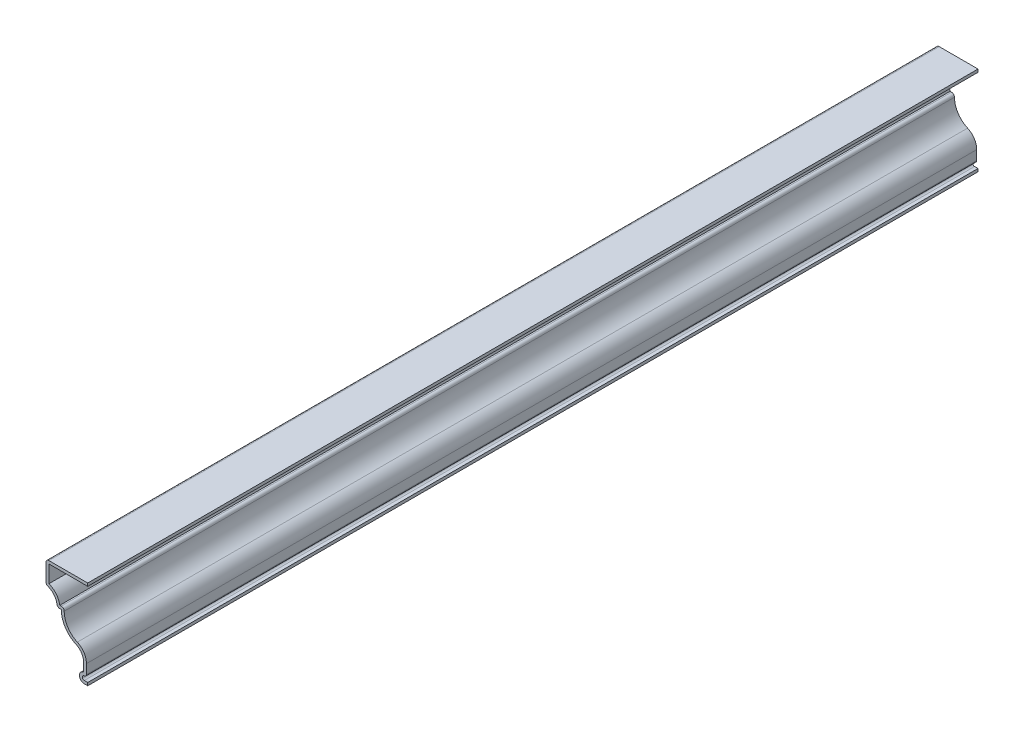
ISO-10303-21;
HEADER;
FILE_DESCRIPTION(('STEP AP214'),'2;1');
FILE_NAME('part.step','',(''),(''),'','','');
FILE_SCHEMA(('AUTOMOTIVE_DESIGN { 1 0 10303 214 1 1 1 1 }'));
ENDSEC;
DATA;
#1=APPLICATION_CONTEXT('core data for automotive mechanical design processes');
#2=APPLICATION_PROTOCOL_DEFINITION('international standard','automotive_design',2000,#1);
#3=PRODUCT_CONTEXT('',#1,'mechanical');
#4=PRODUCT('Part','Part','',(#3));
#5=PRODUCT_RELATED_PRODUCT_CATEGORY('part','',(#4));
#6=PRODUCT_DEFINITION_FORMATION('','',#4);
#7=PRODUCT_DEFINITION_CONTEXT('part definition',#1,'design');
#8=PRODUCT_DEFINITION('design','',#6,#7);
#9=PRODUCT_DEFINITION_SHAPE('','',#8);
#10=(LENGTH_UNIT() NAMED_UNIT(*) SI_UNIT(.MILLI.,.METRE.));
#11=(NAMED_UNIT(*) PLANE_ANGLE_UNIT() SI_UNIT($,.RADIAN.));
#12=(NAMED_UNIT(*) SI_UNIT($,.STERADIAN.) SOLID_ANGLE_UNIT());
#13=UNCERTAINTY_MEASURE_WITH_UNIT(LENGTH_MEASURE(1.E-05),#10,'distance_accuracy_value','');
#14=(GEOMETRIC_REPRESENTATION_CONTEXT(3) GLOBAL_UNCERTAINTY_ASSIGNED_CONTEXT((#13)) GLOBAL_UNIT_ASSIGNED_CONTEXT((#10,
#11,#12)) REPRESENTATION_CONTEXT('',''));
#15=CARTESIAN_POINT('',(0.,0.,0.));
#16=DIRECTION('',(0.,0.,1.));
#17=DIRECTION('',(1.,0.,0.));
#18=AXIS2_PLACEMENT_3D('',#15,#16,#17);
#19=CARTESIAN_POINT('',(0.,1.651,-508.));
#20=DIRECTION('',(1.,0.,0.));
#21=DIRECTION('',(0.,0.,-1.));
#22=AXIS2_PLACEMENT_3D('',#19,#20,#21);
#23=PLANE('',#22);
#24=DIRECTION('',(0.,1.,0.));
#25=VECTOR('',#24,1.);
#26=CARTESIAN_POINT('',(0.,1.651,0.));
#27=LINE('',#26,#25);
#28=CARTESIAN_POINT('',(0.,0.,0.));
#29=VERTEX_POINT('',#28);
#30=CARTESIAN_POINT('',(0.,1.651,0.));
#31=VERTEX_POINT('',#30);
#32=EDGE_CURVE('E287',#29,#31,#27,.T.);
#33=ORIENTED_EDGE('',*,*,#32,.F.);
#34=DIRECTION('',(0.,0.,1.));
#35=VECTOR('',#34,1.);
#36=CARTESIAN_POINT('',(0.,0.,-508.));
#37=LINE('',#36,#35);
#38=CARTESIAN_POINT('',(0.,0.,-508.));
#39=VERTEX_POINT('',#38);
#40=EDGE_CURVE('E230',#39,#29,#37,.T.);
#41=ORIENTED_EDGE('',*,*,#40,.F.);
#42=DIRECTION('',(0.,1.,0.));
#43=VECTOR('',#42,1.);
#44=CARTESIAN_POINT('',(0.,1.651,-508.));
#45=LINE('',#44,#43);
#46=CARTESIAN_POINT('',(0.,1.651,-508.));
#47=VERTEX_POINT('',#46);
#48=EDGE_CURVE('E224',#39,#47,#45,.T.);
#49=ORIENTED_EDGE('',*,*,#48,.T.);
#50=DIRECTION('',(0.,0.,1.));
#51=VECTOR('',#50,1.);
#52=CARTESIAN_POINT('',(0.,1.651,-508.));
#53=LINE('',#52,#51);
#54=EDGE_CURVE('E206',#47,#31,#53,.T.);
#55=ORIENTED_EDGE('',*,*,#54,.T.);
#56=EDGE_LOOP('',(#33,#41,#49,#55));
#57=FACE_BOUND('',#56,.T.);
#58=ADVANCED_FACE('F39',(#57),#23,.T.);
#59=CARTESIAN_POINT('',(0.,0.,-508.));
#60=DIRECTION('',(0.,-1.,0.));
#61=DIRECTION('',(1.,0.,0.));
#62=AXIS2_PLACEMENT_3D('',#59,#60,#61);
#63=PLANE('',#62);
#64=DIRECTION('',(1.,0.,0.));
#65=VECTOR('',#64,1.);
#66=CARTESIAN_POINT('',(0.,0.,0.));
#67=LINE('',#66,#65);
#68=CARTESIAN_POINT('',(-1.96908792936124,0.,0.));
#69=VERTEX_POINT('',#68);
#70=EDGE_CURVE('E231',#69,#29,#67,.T.);
#71=ORIENTED_EDGE('',*,*,#70,.F.);
#72=DIRECTION('',(0.,0.,1.));
#73=VECTOR('',#72,1.);
#74=CARTESIAN_POINT('',(-1.96908792936124,0.,-508.));
#75=LINE('',#74,#73);
#76=CARTESIAN_POINT('',(-1.96908792936124,0.,-508.));
#77=VERTEX_POINT('',#76);
#78=EDGE_CURVE('E343',#77,#69,#75,.T.);
#79=ORIENTED_EDGE('',*,*,#78,.F.);
#80=DIRECTION('',(1.,0.,0.));
#81=VECTOR('',#80,1.);
#82=CARTESIAN_POINT('',(0.,0.,-508.));
#83=LINE('',#82,#81);
#84=EDGE_CURVE('E217',#77,#39,#83,.T.);
#85=ORIENTED_EDGE('',*,*,#84,.T.);
#86=ORIENTED_EDGE('',*,*,#40,.T.);
#87=EDGE_LOOP('',(#71,#79,#85,#86));
#88=FACE_BOUND('',#87,.T.);
#89=ADVANCED_FACE('F427',(#88),#63,.T.);
#90=CARTESIAN_POINT('',(-1.96908792936124,2.79341207063876,-508.));
#91=DIRECTION('',(0.,0.,1.));
#92=DIRECTION('',(1.,0.,0.));
#93=AXIS2_PLACEMENT_3D('',#90,#91,#92);
#94=CYLINDRICAL_SURFACE('',#93,2.79341207063876);
#95=CARTESIAN_POINT('',(-1.96908792936124,2.79341207063876,0.));
#96=DIRECTION('',(0.,0.,1.));
#97=DIRECTION('',(-1.,0.,0.));
#98=AXIS2_PLACEMENT_3D('',#95,#96,#97);
#99=CIRCLE('',#98,2.79341207063876);
#100=CARTESIAN_POINT('',(-2.38125,5.55625,0.));
#101=VERTEX_POINT('',#100);
#102=EDGE_CURVE('E234',#101,#69,#99,.T.);
#103=ORIENTED_EDGE('',*,*,#102,.F.);
#104=DIRECTION('',(0.,0.,1.));
#105=VECTOR('',#104,1.);
#106=CARTESIAN_POINT('',(-2.38125,5.55625,-508.));
#107=LINE('',#106,#105);
#108=CARTESIAN_POINT('',(-2.38125,5.55625,-508.));
#109=VERTEX_POINT('',#108);
#110=EDGE_CURVE('E345',#109,#101,#107,.T.);
#111=ORIENTED_EDGE('',*,*,#110,.F.);
#112=CARTESIAN_POINT('',(-1.96908792936124,2.79341207063876,-508.));
#113=DIRECTION('',(0.,0.,1.));
#114=DIRECTION('',(-1.,0.,0.));
#115=AXIS2_PLACEMENT_3D('',#112,#113,#114);
#116=CIRCLE('',#115,2.79341207063876);
#117=EDGE_CURVE('E283',#109,#77,#116,.T.);
#118=ORIENTED_EDGE('',*,*,#117,.T.);
#119=ORIENTED_EDGE('',*,*,#78,.T.);
#120=EDGE_LOOP('',(#103,#111,#118,#119));
#121=FACE_BOUND('',#120,.T.);
#122=ADVANCED_FACE('F500',(#121),#94,.T.);
#123=CARTESIAN_POINT('',(-2.38125,5.55625,-508.));
#124=DIRECTION('',(-1.,0.,0.));
#125=DIRECTION('',(0.,-1.,0.));
#126=AXIS2_PLACEMENT_3D('',#123,#124,#125);
#127=PLANE('',#126);
#128=DIRECTION('',(0.,-1.,0.));
#129=VECTOR('',#128,1.);
#130=CARTESIAN_POINT('',(-2.38125,5.55625,0.));
#131=LINE('',#130,#129);
#132=CARTESIAN_POINT('',(-2.38125,10.5904855405735,0.));
#133=VERTEX_POINT('',#132);
#134=EDGE_CURVE('E336',#133,#101,#131,.T.);
#135=ORIENTED_EDGE('',*,*,#134,.F.);
#136=DIRECTION('',(0.,0.,1.));
#137=VECTOR('',#136,1.);
#138=CARTESIAN_POINT('',(-2.38125,10.5904855405735,-508.));
#139=LINE('',#138,#137);
#140=CARTESIAN_POINT('',(-2.38125,10.5904855405735,-508.));
#141=VERTEX_POINT('',#140);
#142=EDGE_CURVE('E347',#141,#133,#139,.T.);
#143=ORIENTED_EDGE('',*,*,#142,.F.);
#144=DIRECTION('',(0.,-1.,0.));
#145=VECTOR('',#144,1.);
#146=CARTESIAN_POINT('',(-2.38125,5.55625,-508.));
#147=LINE('',#146,#145);
#148=EDGE_CURVE('E280',#141,#109,#147,.T.);
#149=ORIENTED_EDGE('',*,*,#148,.T.);
#150=ORIENTED_EDGE('',*,*,#110,.T.);
#151=EDGE_LOOP('',(#135,#143,#149,#150));
#152=FACE_BOUND('',#151,.T.);
#153=ADVANCED_FACE('F434',(#152),#127,.T.);
#154=CARTESIAN_POINT('',(-9.525,10.5904855405735,-508.));
#155=DIRECTION('',(0.,0.,1.));
#156=DIRECTION('',(1.,0.,0.));
#157=AXIS2_PLACEMENT_3D('',#154,#155,#156);
#158=CYLINDRICAL_SURFACE('',#157,7.14375);
#159=CARTESIAN_POINT('',(-9.525,10.5904855405735,0.));
#160=DIRECTION('',(0.,0.,-1.));
#161=DIRECTION('',(1.,0.,0.));
#162=AXIS2_PLACEMENT_3D('',#159,#160,#161);
#163=CIRCLE('',#162,7.14375);
#164=CARTESIAN_POINT('',(-6.61458333333333,17.1144903603823,0.));
#165=VERTEX_POINT('',#164);
#166=EDGE_CURVE('E333',#165,#133,#163,.T.);
#167=ORIENTED_EDGE('',*,*,#166,.F.);
#168=DIRECTION('',(0.,0.,1.));
#169=VECTOR('',#168,1.);
#170=CARTESIAN_POINT('',(-6.61458333333333,17.1144903603823,-508.));
#171=LINE('',#170,#169);
#172=CARTESIAN_POINT('',(-6.61458333333333,17.1144903603823,-508.));
#173=VERTEX_POINT('',#172);
#174=EDGE_CURVE('E349',#173,#165,#171,.T.);
#175=ORIENTED_EDGE('',*,*,#174,.F.);
#176=CARTESIAN_POINT('',(-9.525,10.5904855405735,-508.));
#177=DIRECTION('',(0.,0.,-1.));
#178=DIRECTION('',(1.,0.,0.));
#179=AXIS2_PLACEMENT_3D('',#176,#177,#178);
#180=CIRCLE('',#179,7.14375);
#181=EDGE_CURVE('E277',#173,#141,#180,.T.);
#182=ORIENTED_EDGE('',*,*,#181,.T.);
#183=ORIENTED_EDGE('',*,*,#142,.T.);
#184=EDGE_LOOP('',(#167,#175,#182,#183));
#185=FACE_BOUND('',#184,.T.);
#186=ADVANCED_FACE('F437',(#185),#158,.F.);
#187=CARTESIAN_POINT('',(-0.793750000000006,30.1625,-508.));
#188=DIRECTION('',(0.,0.,1.));
#189=DIRECTION('',(1.,0.,0.));
#190=AXIS2_PLACEMENT_3D('',#187,#188,#189);
#191=CYLINDRICAL_SURFACE('',#190,14.2875);
#192=CARTESIAN_POINT('',(-0.793750000000006,30.1625,0.));
#193=DIRECTION('',(0.,0.,1.));
#194=DIRECTION('',(-1.,0.,0.));
#195=AXIS2_PLACEMENT_3D('',#192,#193,#194);
#196=CIRCLE('',#195,14.2875);
#197=CARTESIAN_POINT('',(-15.08125,30.1625,0.));
#198=VERTEX_POINT('',#197);
#199=EDGE_CURVE('E330',#198,#165,#196,.T.);
#200=ORIENTED_EDGE('',*,*,#199,.F.);
#201=DIRECTION('',(0.,0.,1.));
#202=VECTOR('',#201,1.);
#203=CARTESIAN_POINT('',(-15.08125,30.1625,-508.));
#204=LINE('',#203,#202);
#205=CARTESIAN_POINT('',(-15.08125,30.1625,-508.));
#206=VERTEX_POINT('',#205);
#207=EDGE_CURVE('E351',#206,#198,#204,.T.);
#208=ORIENTED_EDGE('',*,*,#207,.F.);
#209=CARTESIAN_POINT('',(-0.793750000000006,30.1625,-508.));
#210=DIRECTION('',(0.,0.,1.));
#211=DIRECTION('',(-1.,0.,0.));
#212=AXIS2_PLACEMENT_3D('',#209,#210,#211);
#213=CIRCLE('',#212,14.2875);
#214=EDGE_CURVE('E274',#206,#173,#213,.T.);
#215=ORIENTED_EDGE('',*,*,#214,.T.);
#216=ORIENTED_EDGE('',*,*,#174,.T.);
#217=EDGE_LOOP('',(#200,#208,#215,#216));
#218=FACE_BOUND('',#217,.T.);
#219=ADVANCED_FACE('F443',(#218),#191,.T.);
#220=CARTESIAN_POINT('',(-15.08125,30.1625,-508.));
#221=DIRECTION('',(0.,-1.,0.));
#222=DIRECTION('',(0.,0.,-1.));
#223=AXIS2_PLACEMENT_3D('',#220,#221,#222);
#224=PLANE('',#223);
#225=DIRECTION('',(1.,0.,0.));
#226=VECTOR('',#225,1.);
#227=CARTESIAN_POINT('',(-15.08125,30.1625,0.));
#228=LINE('',#227,#226);
#229=CARTESIAN_POINT('',(-15.9265136780129,30.1625,0.));
#230=VERTEX_POINT('',#229);
#231=EDGE_CURVE('E328',#230,#198,#228,.T.);
#232=ORIENTED_EDGE('',*,*,#231,.F.);
#233=DIRECTION('',(0.,0.,1.));
#234=VECTOR('',#233,1.);
#235=CARTESIAN_POINT('',(-15.9265136780129,30.1625,-508.));
#236=LINE('',#235,#234);
#237=CARTESIAN_POINT('',(-15.9265136780129,30.1625,-508.));
#238=VERTEX_POINT('',#237);
#239=EDGE_CURVE('E401',#230,#238,#236,.F.);
#240=ORIENTED_EDGE('',*,*,#239,.T.);
#241=DIRECTION('',(1.,0.,0.));
#242=VECTOR('',#241,1.);
#243=CARTESIAN_POINT('',(-15.08125,30.1625,-508.));
#244=LINE('',#243,#242);
#245=EDGE_CURVE('E272',#238,#206,#244,.T.);
#246=ORIENTED_EDGE('',*,*,#245,.T.);
#247=ORIENTED_EDGE('',*,*,#207,.T.);
#248=EDGE_LOOP('',(#232,#240,#246,#247));
#249=FACE_BOUND('',#248,.T.);
#250=ADVANCED_FACE('F446',(#249),#224,.T.);
#251=CARTESIAN_POINT('',(-25.3983864136416,30.3225408690867,-508.));
#252=DIRECTION('',(0.,0.,1.));
#253=DIRECTION('',(1.,0.,0.));
#254=AXIS2_PLACEMENT_3D('',#251,#252,#253);
#255=CYLINDRICAL_SURFACE('',#254,7.9375);
#256=CARTESIAN_POINT('',(-25.3983864136416,30.3225408690867,0.));
#257=DIRECTION('',(0.,0.,-1.));
#258=DIRECTION('',(-1.,0.,0.));
#259=AXIS2_PLACEMENT_3D('',#256,#257,#258);
#260=CIRCLE('',#259,7.9375);
#261=CARTESIAN_POINT('',(-22.7188446804946,37.7940843743019,0.));
#262=VERTEX_POINT('',#261);
#263=CARTESIAN_POINT('',(-17.5574321622934,31.5567785602401,0.));
#264=VERTEX_POINT('',#263);
#265=EDGE_CURVE('E325',#262,#264,#260,.T.);
#266=ORIENTED_EDGE('',*,*,#265,.F.);
#267=DIRECTION('',(0.,0.,1.));
#268=VECTOR('',#267,1.);
#269=CARTESIAN_POINT('',(-22.7188446804946,37.7940843743019,-508.));
#270=LINE('',#269,#268);
#271=CARTESIAN_POINT('',(-22.7188446804946,37.7940843743019,-508.));
#272=VERTEX_POINT('',#271);
#273=EDGE_CURVE('E399',#262,#272,#270,.F.);
#274=ORIENTED_EDGE('',*,*,#273,.T.);
#275=CARTESIAN_POINT('',(-25.3983864136416,30.3225408690867,-508.));
#276=DIRECTION('',(0.,0.,-1.));
#277=DIRECTION('',(-1.,0.,0.));
#278=AXIS2_PLACEMENT_3D('',#275,#276,#277);
#279=CIRCLE('',#278,7.9375);
#280=CARTESIAN_POINT('',(-17.5574321622934,31.5567785602401,-508.));
#281=VERTEX_POINT('',#280);
#282=EDGE_CURVE('E269',#272,#281,#279,.T.);
#283=ORIENTED_EDGE('',*,*,#282,.T.);
#284=DIRECTION('',(0.,0.,1.));
#285=VECTOR('',#284,1.);
#286=CARTESIAN_POINT('',(-17.5574321622934,31.5567785602401,-508.));
#287=LINE('',#286,#285);
#288=EDGE_CURVE('E396',#281,#264,#287,.T.);
#289=ORIENTED_EDGE('',*,*,#288,.T.);
#290=EDGE_LOOP('',(#266,#274,#283,#289));
#291=FACE_BOUND('',#290,.T.);
#292=ADVANCED_FACE('F455',(#291),#255,.F.);
#293=CARTESIAN_POINT('',(-23.8125,50.8,-508.));
#294=DIRECTION('',(-1.,0.,0.));
#295=DIRECTION('',(0.,0.,1.));
#296=AXIS2_PLACEMENT_3D('',#293,#294,#295);
#297=PLANE('',#296);
#298=DIRECTION('',(0.,-1.,0.));
#299=VECTOR('',#298,1.);
#300=CARTESIAN_POINT('',(-23.8125,50.8,0.));
#301=LINE('',#300,#299);
#302=CARTESIAN_POINT('',(-23.8125,49.149,0.));
#303=VERTEX_POINT('',#302);
#304=CARTESIAN_POINT('',(-23.8125,39.3481654233866,0.));
#305=VERTEX_POINT('',#304);
#306=EDGE_CURVE('E322',#303,#305,#301,.T.);
#307=ORIENTED_EDGE('',*,*,#306,.F.);
#308=DIRECTION('',(0.,0.,1.));
#309=VECTOR('',#308,1.);
#310=CARTESIAN_POINT('',(-23.8125,49.149,-508.));
#311=LINE('',#310,#309);
#312=CARTESIAN_POINT('',(-23.8125,49.149,-508.));
#313=VERTEX_POINT('',#312);
#314=EDGE_CURVE('E387',#303,#313,#311,.F.);
#315=ORIENTED_EDGE('',*,*,#314,.T.);
#316=DIRECTION('',(0.,-1.,0.));
#317=VECTOR('',#316,1.);
#318=CARTESIAN_POINT('',(-23.8125,50.8,-508.));
#319=LINE('',#318,#317);
#320=CARTESIAN_POINT('',(-23.8125,39.3481654233866,-508.));
#321=VERTEX_POINT('',#320);
#322=EDGE_CURVE('E266',#313,#321,#319,.T.);
#323=ORIENTED_EDGE('',*,*,#322,.T.);
#324=DIRECTION('',(0.,0.,1.));
#325=VECTOR('',#324,1.);
#326=CARTESIAN_POINT('',(-23.8125,39.3481654233866,-508.));
#327=LINE('',#326,#325);
#328=EDGE_CURVE('E384',#321,#305,#327,.T.);
#329=ORIENTED_EDGE('',*,*,#328,.T.);
#330=EDGE_LOOP('',(#307,#315,#323,#329));
#331=FACE_BOUND('',#330,.T.);
#332=ADVANCED_FACE('F463',(#331),#297,.T.);
#333=CARTESIAN_POINT('',(0.,50.8,-508.));
#334=DIRECTION('',(0.,1.,0.));
#335=DIRECTION('',(-1.,0.,0.));
#336=AXIS2_PLACEMENT_3D('',#333,#334,#335);
#337=PLANE('',#336);
#338=DIRECTION('',(-1.,0.,0.));
#339=VECTOR('',#338,1.);
#340=CARTESIAN_POINT('',(0.,50.8,-508.));
#341=LINE('',#340,#339);
#342=CARTESIAN_POINT('',(0.,50.8,-508.));
#343=VERTEX_POINT('',#342);
#344=CARTESIAN_POINT('',(-22.1615,50.8,-508.));
#345=VERTEX_POINT('',#344);
#346=EDGE_CURVE('E263',#343,#345,#341,.T.);
#347=ORIENTED_EDGE('',*,*,#346,.T.);
#348=DIRECTION('',(0.,0.,1.));
#349=VECTOR('',#348,1.);
#350=CARTESIAN_POINT('',(-22.1615,50.8,-508.));
#351=LINE('',#350,#349);
#352=CARTESIAN_POINT('',(-22.1615,50.8,0.));
#353=VERTEX_POINT('',#352);
#354=EDGE_CURVE('E342',#345,#353,#351,.T.);
#355=ORIENTED_EDGE('',*,*,#354,.T.);
#356=DIRECTION('',(-1.,0.,0.));
#357=VECTOR('',#356,1.);
#358=CARTESIAN_POINT('',(0.,50.8,0.));
#359=LINE('',#358,#357);
#360=CARTESIAN_POINT('',(0.,50.8,0.));
#361=VERTEX_POINT('',#360);
#362=EDGE_CURVE('E319',#361,#353,#359,.T.);
#363=ORIENTED_EDGE('',*,*,#362,.F.);
#364=DIRECTION('',(0.,0.,1.));
#365=VECTOR('',#364,1.);
#366=CARTESIAN_POINT('',(0.,50.8,-508.));
#367=LINE('',#366,#365);
#368=EDGE_CURVE('E354',#343,#361,#367,.T.);
#369=ORIENTED_EDGE('',*,*,#368,.F.);
#370=EDGE_LOOP('',(#347,#355,#363,#369));
#371=FACE_BOUND('',#370,.T.);
#372=ADVANCED_FACE('F472',(#371),#337,.T.);
#373=CARTESIAN_POINT('',(0.,50.8,-508.));
#374=DIRECTION('',(1.,0.,0.));
#375=DIRECTION('',(0.,0.,-1.));
#376=AXIS2_PLACEMENT_3D('',#373,#374,#375);
#377=PLANE('',#376);
#378=DIRECTION('',(0.,1.,0.));
#379=VECTOR('',#378,1.);
#380=CARTESIAN_POINT('',(0.,50.8,0.));
#381=LINE('',#380,#379);
#382=CARTESIAN_POINT('',(0.,49.149,0.));
#383=VERTEX_POINT('',#382);
#384=EDGE_CURVE('E316',#383,#361,#381,.T.);
#385=ORIENTED_EDGE('',*,*,#384,.F.);
#386=DIRECTION('',(0.,0.,1.));
#387=VECTOR('',#386,1.);
#388=CARTESIAN_POINT('',(0.,49.149,-508.));
#389=LINE('',#388,#387);
#390=CARTESIAN_POINT('',(0.,49.149,-508.));
#391=VERTEX_POINT('',#390);
#392=EDGE_CURVE('E356',#391,#383,#389,.T.);
#393=ORIENTED_EDGE('',*,*,#392,.F.);
#394=DIRECTION('',(0.,1.,0.));
#395=VECTOR('',#394,1.);
#396=CARTESIAN_POINT('',(0.,50.8,-508.));
#397=LINE('',#396,#395);
#398=EDGE_CURVE('E260',#391,#343,#397,.T.);
#399=ORIENTED_EDGE('',*,*,#398,.T.);
#400=ORIENTED_EDGE('',*,*,#368,.T.);
#401=EDGE_LOOP('',(#385,#393,#399,#400));
#402=FACE_BOUND('',#401,.T.);
#403=ADVANCED_FACE('F476',(#402),#377,.T.);
#404=CARTESIAN_POINT('',(0.,49.149,-508.));
#405=DIRECTION('',(0.,-1.,0.));
#406=DIRECTION('',(0.,0.,-1.));
#407=AXIS2_PLACEMENT_3D('',#404,#405,#406);
#408=PLANE('',#407);
#409=DIRECTION('',(1.,0.,0.));
#410=VECTOR('',#409,1.);
#411=CARTESIAN_POINT('',(0.,49.149,0.));
#412=LINE('',#411,#410);
#413=CARTESIAN_POINT('',(-22.1615,49.149,0.));
#414=VERTEX_POINT('',#413);
#415=EDGE_CURVE('E313',#414,#383,#412,.T.);
#416=ORIENTED_EDGE('',*,*,#415,.F.);
#417=DIRECTION('',(0.,0.,1.));
#418=VECTOR('',#417,1.);
#419=CARTESIAN_POINT('',(-22.1615,49.149,-508.));
#420=LINE('',#419,#418);
#421=CARTESIAN_POINT('',(-22.1615,49.149,-508.));
#422=VERTEX_POINT('',#421);
#423=EDGE_CURVE('E358',#422,#414,#420,.T.);
#424=ORIENTED_EDGE('',*,*,#423,.F.);
#425=DIRECTION('',(1.,0.,0.));
#426=VECTOR('',#425,1.);
#427=CARTESIAN_POINT('',(0.,49.149,-508.));
#428=LINE('',#427,#426);
#429=EDGE_CURVE('E257',#422,#391,#428,.T.);
#430=ORIENTED_EDGE('',*,*,#429,.T.);
#431=ORIENTED_EDGE('',*,*,#392,.T.);
#432=EDGE_LOOP('',(#416,#424,#430,#431));
#433=FACE_BOUND('',#432,.T.);
#434=ADVANCED_FACE('F481',(#433),#408,.T.);
#435=CARTESIAN_POINT('',(-22.1615,49.149,-508.));
#436=DIRECTION('',(1.,0.,0.));
#437=DIRECTION('',(0.,0.,-1.));
#438=AXIS2_PLACEMENT_3D('',#435,#436,#437);
#439=PLANE('',#438);
#440=DIRECTION('',(0.,1.,0.));
#441=VECTOR('',#440,1.);
#442=CARTESIAN_POINT('',(-22.1615,49.149,0.));
#443=LINE('',#442,#441);
#444=CARTESIAN_POINT('',(-22.1615,39.3481654233866,0.));
#445=VERTEX_POINT('',#444);
#446=EDGE_CURVE('E310',#445,#414,#443,.T.);
#447=ORIENTED_EDGE('',*,*,#446,.F.);
#448=DIRECTION('',(0.,0.,1.));
#449=VECTOR('',#448,1.);
#450=CARTESIAN_POINT('',(-22.1615,39.3481654233866,-508.));
#451=LINE('',#450,#449);
#452=CARTESIAN_POINT('',(-22.1615,39.3481654233866,-508.));
#453=VERTEX_POINT('',#452);
#454=EDGE_CURVE('E360',#453,#445,#451,.T.);
#455=ORIENTED_EDGE('',*,*,#454,.F.);
#456=DIRECTION('',(0.,1.,0.));
#457=VECTOR('',#456,1.);
#458=CARTESIAN_POINT('',(-22.1615,49.149,-508.));
#459=LINE('',#458,#457);
#460=EDGE_CURVE('E254',#453,#422,#459,.T.);
#461=ORIENTED_EDGE('',*,*,#460,.T.);
#462=ORIENTED_EDGE('',*,*,#423,.T.);
#463=EDGE_LOOP('',(#447,#455,#461,#462));
#464=FACE_BOUND('',#463,.T.);
#465=ADVANCED_FACE('F484',(#464),#439,.T.);
#466=CARTESIAN_POINT('',(-25.3983864136416,30.3225408690867,-508.));
#467=DIRECTION('',(0.,0.,1.));
#468=DIRECTION('',(1.,0.,0.));
#469=AXIS2_PLACEMENT_3D('',#466,#467,#468);
#470=CYLINDRICAL_SURFACE('',#469,9.5885);
#471=CARTESIAN_POINT('',(-25.3983864136416,30.3225408690867,0.));
#472=DIRECTION('',(0.,0.,1.));
#473=DIRECTION('',(-1.,0.,0.));
#474=AXIS2_PLACEMENT_3D('',#471,#472,#473);
#475=CIRCLE('',#474,9.5885);
#476=CARTESIAN_POINT('',(-15.9265136780129,31.8135,0.));
#477=VERTEX_POINT('',#476);
#478=EDGE_CURVE('E307',#477,#445,#475,.T.);
#479=ORIENTED_EDGE('',*,*,#478,.F.);
#480=DIRECTION('',(0.,0.,1.));
#481=VECTOR('',#480,1.);
#482=CARTESIAN_POINT('',(-15.9265136780129,31.8135,-508.));
#483=LINE('',#482,#481);
#484=CARTESIAN_POINT('',(-15.9265136780129,31.8135,-508.));
#485=VERTEX_POINT('',#484);
#486=EDGE_CURVE('E362',#485,#477,#483,.T.);
#487=ORIENTED_EDGE('',*,*,#486,.F.);
#488=CARTESIAN_POINT('',(-25.3983864136416,30.3225408690867,-508.));
#489=DIRECTION('',(0.,0.,1.));
#490=DIRECTION('',(-1.,0.,0.));
#491=AXIS2_PLACEMENT_3D('',#488,#489,#490);
#492=CIRCLE('',#491,9.5885);
#493=EDGE_CURVE('E251',#485,#453,#492,.T.);
#494=ORIENTED_EDGE('',*,*,#493,.T.);
#495=ORIENTED_EDGE('',*,*,#454,.T.);
#496=EDGE_LOOP('',(#479,#487,#494,#495));
#497=FACE_BOUND('',#496,.T.);
#498=ADVANCED_FACE('F489',(#497),#470,.T.);
#499=CARTESIAN_POINT('',(-13.3219314821625,31.8135,-508.));
#500=DIRECTION('',(0.,1.,0.));
#501=DIRECTION('',(0.,0.,1.));
#502=AXIS2_PLACEMENT_3D('',#499,#500,#501);
#503=PLANE('',#502);
#504=DIRECTION('',(-1.,0.,0.));
#505=VECTOR('',#504,1.);
#506=CARTESIAN_POINT('',(-13.3219314821625,31.8135,0.));
#507=LINE('',#506,#505);
#508=CARTESIAN_POINT('',(-15.08125,31.8135,0.));
#509=VERTEX_POINT('',#508);
#510=EDGE_CURVE('E305',#509,#477,#507,.T.);
#511=ORIENTED_EDGE('',*,*,#510,.F.);
#512=DIRECTION('',(0.,0.,1.));
#513=VECTOR('',#512,1.);
#514=CARTESIAN_POINT('',(-15.08125,31.8135,-508.));
#515=LINE('',#514,#513);
#516=CARTESIAN_POINT('',(-15.08125,31.8135,-508.));
#517=VERTEX_POINT('',#516);
#518=EDGE_CURVE('E11',#509,#517,#515,.F.);
#519=ORIENTED_EDGE('',*,*,#518,.T.);
#520=DIRECTION('',(-1.,0.,0.));
#521=VECTOR('',#520,1.);
#522=CARTESIAN_POINT('',(-13.3219314821625,31.8135,-508.));
#523=LINE('',#522,#521);
#524=EDGE_CURVE('E249',#517,#485,#523,.T.);
#525=ORIENTED_EDGE('',*,*,#524,.T.);
#526=ORIENTED_EDGE('',*,*,#486,.T.);
#527=EDGE_LOOP('',(#511,#519,#525,#526));
#528=FACE_BOUND('',#527,.T.);
#529=ADVANCED_FACE('F490',(#528),#503,.T.);
#530=CARTESIAN_POINT('',(-0.793750000000006,30.1625,-508.));
#531=DIRECTION('',(0.,0.,1.));
#532=DIRECTION('',(1.,0.,0.));
#533=AXIS2_PLACEMENT_3D('',#530,#531,#532);
#534=CYLINDRICAL_SURFACE('',#533,12.6365);
#535=CARTESIAN_POINT('',(-0.793750000000006,30.1625,-508.));
#536=DIRECTION('',(0.,0.,-1.));
#537=DIRECTION('',(-1.,0.,0.));
#538=AXIS2_PLACEMENT_3D('',#535,#536,#537);
#539=CIRCLE('',#538,12.6365);
#540=CARTESIAN_POINT('',(-5.94195370370371,18.6222603631826,-508.));
#541=VERTEX_POINT('',#540);
#542=CARTESIAN_POINT('',(-13.43025,30.1625,-508.));
#543=VERTEX_POINT('',#542);
#544=EDGE_CURVE('E247',#541,#543,#539,.T.);
#545=ORIENTED_EDGE('',*,*,#544,.T.);
#546=DIRECTION('',(0.,0.,1.));
#547=VECTOR('',#546,1.);
#548=CARTESIAN_POINT('',(-13.43025,30.1625,-508.));
#549=LINE('',#548,#547);
#550=CARTESIAN_POINT('',(-13.43025,30.1625,0.));
#551=VERTEX_POINT('',#550);
#552=EDGE_CURVE('E47',#543,#551,#549,.T.);
#553=ORIENTED_EDGE('',*,*,#552,.T.);
#554=CARTESIAN_POINT('',(-0.793750000000006,30.1625,0.));
#555=DIRECTION('',(0.,0.,-1.));
#556=DIRECTION('',(-1.,0.,0.));
#557=AXIS2_PLACEMENT_3D('',#554,#555,#556);
#558=CIRCLE('',#557,12.6365);
#559=CARTESIAN_POINT('',(-5.94195370370371,18.6222603631826,0.));
#560=VERTEX_POINT('',#559);
#561=EDGE_CURVE('E302',#560,#551,#558,.T.);
#562=ORIENTED_EDGE('',*,*,#561,.F.);
#563=DIRECTION('',(0.,0.,1.));
#564=VECTOR('',#563,1.);
#565=CARTESIAN_POINT('',(-5.94195370370371,18.6222603631826,-508.));
#566=LINE('',#565,#564);
#567=EDGE_CURVE('E365',#541,#560,#566,.T.);
#568=ORIENTED_EDGE('',*,*,#567,.F.);
#569=EDGE_LOOP('',(#545,#553,#562,#568));
#570=FACE_BOUND('',#569,.T.);
#571=ADVANCED_FACE('F406',(#570),#534,.F.);
#572=CARTESIAN_POINT('',(-9.525,10.5904855405735,-508.));
#573=DIRECTION('',(0.,0.,1.));
#574=DIRECTION('',(1.,0.,0.));
#575=AXIS2_PLACEMENT_3D('',#572,#573,#574);
#576=CYLINDRICAL_SURFACE('',#575,8.79475);
#577=CARTESIAN_POINT('',(-9.525,10.5904855405735,0.));
#578=DIRECTION('',(0.,0.,1.));
#579=DIRECTION('',(1.,0.,0.));
#580=AXIS2_PLACEMENT_3D('',#577,#578,#579);
#581=CIRCLE('',#580,8.79475);
#582=CARTESIAN_POINT('',(-0.730249999999998,10.5904855405735,0.));
#583=VERTEX_POINT('',#582);
#584=EDGE_CURVE('E299',#583,#560,#581,.T.);
#585=ORIENTED_EDGE('',*,*,#584,.F.);
#586=DIRECTION('',(0.,0.,1.));
#587=VECTOR('',#586,1.);
#588=CARTESIAN_POINT('',(-0.730249999999998,10.5904855405735,-508.));
#589=LINE('',#588,#587);
#590=CARTESIAN_POINT('',(-0.730249999999998,10.5904855405735,-508.));
#591=VERTEX_POINT('',#590);
#592=EDGE_CURVE('E367',#591,#583,#589,.T.);
#593=ORIENTED_EDGE('',*,*,#592,.F.);
#594=CARTESIAN_POINT('',(-9.525,10.5904855405735,-508.));
#595=DIRECTION('',(0.,0.,1.));
#596=DIRECTION('',(1.,0.,0.));
#597=AXIS2_PLACEMENT_3D('',#594,#595,#596);
#598=CIRCLE('',#597,8.79475);
#599=EDGE_CURVE('E244',#591,#541,#598,.T.);
#600=ORIENTED_EDGE('',*,*,#599,.T.);
#601=ORIENTED_EDGE('',*,*,#567,.T.);
#602=EDGE_LOOP('',(#585,#593,#600,#601));
#603=FACE_BOUND('',#602,.T.);
#604=ADVANCED_FACE('F413',(#603),#576,.T.);
#605=CARTESIAN_POINT('',(-0.73025,5.17466207063876,-508.));
#606=DIRECTION('',(1.,0.,0.));
#607=DIRECTION('',(0.,1.,0.));
#608=AXIS2_PLACEMENT_3D('',#605,#606,#607);
#609=PLANE('',#608);
#610=DIRECTION('',(0.,1.,0.));
#611=VECTOR('',#610,1.);
#612=CARTESIAN_POINT('',(-0.73025,5.17466207063876,0.));
#613=LINE('',#612,#611);
#614=CARTESIAN_POINT('',(-0.73025,5.17466207063876,0.));
#615=VERTEX_POINT('',#614);
#616=EDGE_CURVE('E296',#615,#583,#613,.T.);
#617=ORIENTED_EDGE('',*,*,#616,.F.);
#618=DIRECTION('',(0.,0.,1.));
#619=VECTOR('',#618,1.);
#620=CARTESIAN_POINT('',(-0.73025,5.17466207063876,-508.));
#621=LINE('',#620,#619);
#622=CARTESIAN_POINT('',(-0.73025,5.17466207063876,-508.));
#623=VERTEX_POINT('',#622);
#624=EDGE_CURVE('E369',#623,#615,#621,.T.);
#625=ORIENTED_EDGE('',*,*,#624,.F.);
#626=DIRECTION('',(0.,1.,0.));
#627=VECTOR('',#626,1.);
#628=CARTESIAN_POINT('',(-0.73025,5.17466207063876,-508.));
#629=LINE('',#628,#627);
#630=EDGE_CURVE('E241',#623,#591,#629,.T.);
#631=ORIENTED_EDGE('',*,*,#630,.T.);
#632=ORIENTED_EDGE('',*,*,#592,.T.);
#633=EDGE_LOOP('',(#617,#625,#631,#632));
#634=FACE_BOUND('',#633,.T.);
#635=ADVANCED_FACE('F417',(#634),#609,.T.);
#636=CARTESIAN_POINT('',(-1.96908792936124,5.17466207063876,-508.));
#637=DIRECTION('',(0.,0.,1.));
#638=DIRECTION('',(1.,0.,0.));
#639=AXIS2_PLACEMENT_3D('',#636,#637,#638);
#640=CYLINDRICAL_SURFACE('',#639,1.23883792936124);
#641=CARTESIAN_POINT('',(-1.96908792936124,5.17466207063876,0.));
#642=DIRECTION('',(0.,0.,1.));
#643=DIRECTION('',(1.,0.,0.));
#644=AXIS2_PLACEMENT_3D('',#641,#642,#643);
#645=CIRCLE('',#644,1.23883792936124);
#646=CARTESIAN_POINT('',(-1.96908792936124,3.93582414127752,0.));
#647=VERTEX_POINT('',#646);
#648=EDGE_CURVE('E293',#647,#615,#645,.T.);
#649=ORIENTED_EDGE('',*,*,#648,.F.);
#650=DIRECTION('',(0.,0.,1.));
#651=VECTOR('',#650,1.);
#652=CARTESIAN_POINT('',(-1.96908792936124,3.93582414127752,-508.));
#653=LINE('',#652,#651);
#654=CARTESIAN_POINT('',(-1.96908792936124,3.93582414127752,-508.));
#655=VERTEX_POINT('',#654);
#656=EDGE_CURVE('E371',#655,#647,#653,.T.);
#657=ORIENTED_EDGE('',*,*,#656,.F.);
#658=CARTESIAN_POINT('',(-1.96908792936124,5.17466207063876,-508.));
#659=DIRECTION('',(0.,0.,1.));
#660=DIRECTION('',(1.,0.,0.));
#661=AXIS2_PLACEMENT_3D('',#658,#659,#660);
#662=CIRCLE('',#661,1.23883792936124);
#663=EDGE_CURVE('E238',#655,#623,#662,.T.);
#664=ORIENTED_EDGE('',*,*,#663,.T.);
#665=ORIENTED_EDGE('',*,*,#624,.T.);
#666=EDGE_LOOP('',(#649,#657,#664,#665));
#667=FACE_BOUND('',#666,.T.);
#668=ADVANCED_FACE('F420',(#667),#640,.T.);
#669=CARTESIAN_POINT('',(-1.96908792936124,2.79341207063876,-508.));
#670=DIRECTION('',(0.,0.,1.));
#671=DIRECTION('',(1.,0.,0.));
#672=AXIS2_PLACEMENT_3D('',#669,#670,#671);
#673=CYLINDRICAL_SURFACE('',#672,1.14241207063876);
#674=CARTESIAN_POINT('',(-1.96908792936124,2.79341207063876,0.));
#675=DIRECTION('',(0.,0.,-1.));
#676=DIRECTION('',(1.,0.,0.));
#677=AXIS2_PLACEMENT_3D('',#674,#675,#676);
#678=CIRCLE('',#677,1.14241207063876);
#679=CARTESIAN_POINT('',(-1.96908792936124,1.651,0.));
#680=VERTEX_POINT('',#679);
#681=EDGE_CURVE('E290',#680,#647,#678,.T.);
#682=ORIENTED_EDGE('',*,*,#681,.F.);
#683=DIRECTION('',(0.,0.,1.));
#684=VECTOR('',#683,1.);
#685=CARTESIAN_POINT('',(-1.96908792936124,1.651,-508.));
#686=LINE('',#685,#684);
#687=CARTESIAN_POINT('',(-1.96908792936124,1.651,-508.));
#688=VERTEX_POINT('',#687);
#689=EDGE_CURVE('E216',#688,#680,#686,.T.);
#690=ORIENTED_EDGE('',*,*,#689,.F.);
#691=CARTESIAN_POINT('',(-1.96908792936124,2.79341207063876,-508.));
#692=DIRECTION('',(0.,0.,-1.));
#693=DIRECTION('',(1.,0.,0.));
#694=AXIS2_PLACEMENT_3D('',#691,#692,#693);
#695=CIRCLE('',#694,1.14241207063876);
#696=EDGE_CURVE('E228',#688,#655,#695,.T.);
#697=ORIENTED_EDGE('',*,*,#696,.T.);
#698=ORIENTED_EDGE('',*,*,#656,.T.);
#699=EDGE_LOOP('',(#682,#690,#697,#698));
#700=FACE_BOUND('',#699,.T.);
#701=ADVANCED_FACE('F423',(#700),#673,.F.);
#702=CARTESIAN_POINT('',(-1.96908792936124,1.651,-508.));
#703=DIRECTION('',(0.,1.,0.));
#704=DIRECTION('',(0.,0.,1.));
#705=AXIS2_PLACEMENT_3D('',#702,#703,#704);
#706=PLANE('',#705);
#707=DIRECTION('',(-1.,0.,0.));
#708=VECTOR('',#707,1.);
#709=CARTESIAN_POINT('',(-1.96908792936124,1.651,0.));
#710=LINE('',#709,#708);
#711=EDGE_CURVE('E211',#31,#680,#710,.T.);
#712=ORIENTED_EDGE('',*,*,#711,.F.);
#713=ORIENTED_EDGE('',*,*,#54,.F.);
#714=DIRECTION('',(-1.,0.,0.));
#715=VECTOR('',#714,1.);
#716=CARTESIAN_POINT('',(-1.96908792936124,1.651,-508.));
#717=LINE('',#716,#715);
#718=EDGE_CURVE('E209',#47,#688,#717,.T.);
#719=ORIENTED_EDGE('',*,*,#718,.T.);
#720=ORIENTED_EDGE('',*,*,#689,.T.);
#721=EDGE_LOOP('',(#712,#713,#719,#720));
#722=FACE_BOUND('',#721,.T.);
#723=ADVANCED_FACE('F208',(#722),#706,.T.);
#724=CARTESIAN_POINT('',(-1.96908792936124,2.79341207063876,-508.));
#725=DIRECTION('',(0.,0.,-1.));
#726=DIRECTION('',(-1.,0.,0.));
#727=AXIS2_PLACEMENT_3D('',#724,#725,#726);
#728=PLANE('',#727);
#729=ORIENTED_EDGE('',*,*,#322,.F.);
#730=CARTESIAN_POINT('',(-22.1615,49.149,-508.));
#731=DIRECTION('',(0.,0.,-1.));
#732=DIRECTION('',(-1.,0.,0.));
#733=AXIS2_PLACEMENT_3D('',#730,#731,#732);
#734=CIRCLE('',#733,1.651);
#735=EDGE_CURVE('E394',#313,#345,#734,.T.);
#736=ORIENTED_EDGE('',*,*,#735,.T.);
#737=ORIENTED_EDGE('',*,*,#346,.F.);
#738=ORIENTED_EDGE('',*,*,#398,.F.);
#739=ORIENTED_EDGE('',*,*,#429,.F.);
#740=ORIENTED_EDGE('',*,*,#460,.F.);
#741=ORIENTED_EDGE('',*,*,#493,.F.);
#742=ORIENTED_EDGE('',*,*,#524,.F.);
#743=CARTESIAN_POINT('',(-15.08125,30.1625,-508.));
#744=DIRECTION('',(0.,0.,-1.));
#745=DIRECTION('',(-1.,0.,0.));
#746=AXIS2_PLACEMENT_3D('',#743,#744,#745);
#747=CIRCLE('',#746,1.651);
#748=EDGE_CURVE('E54',#517,#543,#747,.T.);
#749=ORIENTED_EDGE('',*,*,#748,.T.);
#750=ORIENTED_EDGE('',*,*,#544,.F.);
#751=ORIENTED_EDGE('',*,*,#599,.F.);
#752=ORIENTED_EDGE('',*,*,#630,.F.);
#753=ORIENTED_EDGE('',*,*,#663,.F.);
#754=ORIENTED_EDGE('',*,*,#696,.F.);
#755=ORIENTED_EDGE('',*,*,#718,.F.);
#756=ORIENTED_EDGE('',*,*,#48,.F.);
#757=ORIENTED_EDGE('',*,*,#84,.F.);
#758=ORIENTED_EDGE('',*,*,#117,.F.);
#759=ORIENTED_EDGE('',*,*,#148,.F.);
#760=ORIENTED_EDGE('',*,*,#181,.F.);
#761=ORIENTED_EDGE('',*,*,#214,.F.);
#762=ORIENTED_EDGE('',*,*,#245,.F.);
#763=CARTESIAN_POINT('',(-15.9265136780129,31.8135,-508.));
#764=DIRECTION('',(0.,0.,-1.));
#765=DIRECTION('',(-1.,0.,0.));
#766=AXIS2_PLACEMENT_3D('',#763,#764,#765);
#767=CIRCLE('',#766,1.651);
#768=EDGE_CURVE('E390',#238,#281,#767,.T.);
#769=ORIENTED_EDGE('',*,*,#768,.T.);
#770=ORIENTED_EDGE('',*,*,#282,.F.);
#771=CARTESIAN_POINT('',(-22.1615,39.3481654233866,-508.));
#772=DIRECTION('',(0.,0.,-1.));
#773=DIRECTION('',(-1.,0.,0.));
#774=AXIS2_PLACEMENT_3D('',#771,#772,#773);
#775=CIRCLE('',#774,1.651);
#776=EDGE_CURVE('E392',#272,#321,#775,.T.);
#777=ORIENTED_EDGE('',*,*,#776,.T.);
#778=EDGE_LOOP('',(#729,#736,#737,#738,#739,#740,#741,#742,#749,#750,#751,#752,#753,#754,#755,
#756,#757,#758,#759,#760,#761,#762,#769,#770,#777));
#779=FACE_BOUND('',#778,.T.);
#780=ADVANCED_FACE('F222',(#779),#728,.T.);
#781=CARTESIAN_POINT('',(-1.96908792936124,2.79341207063876,0.));
#782=DIRECTION('',(0.,0.,-1.));
#783=DIRECTION('',(-1.,0.,0.));
#784=AXIS2_PLACEMENT_3D('',#781,#782,#783);
#785=PLANE('',#784);
#786=ORIENTED_EDGE('',*,*,#362,.T.);
#787=CARTESIAN_POINT('',(-22.1615,49.149,0.));
#788=DIRECTION('',(0.,0.,-1.));
#789=DIRECTION('',(-1.,0.,0.));
#790=AXIS2_PLACEMENT_3D('',#787,#788,#789);
#791=CIRCLE('',#790,1.651);
#792=EDGE_CURVE('E382',#353,#303,#791,.F.);
#793=ORIENTED_EDGE('',*,*,#792,.T.);
#794=ORIENTED_EDGE('',*,*,#306,.T.);
#795=CARTESIAN_POINT('',(-22.1615,39.3481654233866,0.));
#796=DIRECTION('',(0.,0.,-1.));
#797=DIRECTION('',(-1.,0.,0.));
#798=AXIS2_PLACEMENT_3D('',#795,#796,#797);
#799=CIRCLE('',#798,1.651);
#800=EDGE_CURVE('E380',#305,#262,#799,.F.);
#801=ORIENTED_EDGE('',*,*,#800,.T.);
#802=ORIENTED_EDGE('',*,*,#265,.T.);
#803=CARTESIAN_POINT('',(-15.9265136780129,31.8135,0.));
#804=DIRECTION('',(0.,0.,-1.));
#805=DIRECTION('',(-1.,0.,0.));
#806=AXIS2_PLACEMENT_3D('',#803,#804,#805);
#807=CIRCLE('',#806,1.651);
#808=EDGE_CURVE('E378',#264,#230,#807,.F.);
#809=ORIENTED_EDGE('',*,*,#808,.T.);
#810=ORIENTED_EDGE('',*,*,#231,.T.);
#811=ORIENTED_EDGE('',*,*,#199,.T.);
#812=ORIENTED_EDGE('',*,*,#166,.T.);
#813=ORIENTED_EDGE('',*,*,#134,.T.);
#814=ORIENTED_EDGE('',*,*,#102,.T.);
#815=ORIENTED_EDGE('',*,*,#70,.T.);
#816=ORIENTED_EDGE('',*,*,#32,.T.);
#817=ORIENTED_EDGE('',*,*,#711,.T.);
#818=ORIENTED_EDGE('',*,*,#681,.T.);
#819=ORIENTED_EDGE('',*,*,#648,.T.);
#820=ORIENTED_EDGE('',*,*,#616,.T.);
#821=ORIENTED_EDGE('',*,*,#584,.T.);
#822=ORIENTED_EDGE('',*,*,#561,.T.);
#823=CARTESIAN_POINT('',(-15.08125,30.1625,0.));
#824=DIRECTION('',(0.,0.,-1.));
#825=DIRECTION('',(-1.,0.,0.));
#826=AXIS2_PLACEMENT_3D('',#823,#824,#825);
#827=CIRCLE('',#826,1.651);
#828=EDGE_CURVE('E376',#551,#509,#827,.F.);
#829=ORIENTED_EDGE('',*,*,#828,.T.);
#830=ORIENTED_EDGE('',*,*,#510,.T.);
#831=ORIENTED_EDGE('',*,*,#478,.T.);
#832=ORIENTED_EDGE('',*,*,#446,.T.);
#833=ORIENTED_EDGE('',*,*,#415,.T.);
#834=ORIENTED_EDGE('',*,*,#384,.T.);
#835=EDGE_LOOP('',(#786,#793,#794,#801,#802,#809,#810,#811,#812,#813,#814,#815,#816,#817,#818,
#819,#820,#821,#822,#829,#830,#831,#832,#833,#834));
#836=FACE_BOUND('',#835,.T.);
#837=ADVANCED_FACE('F409',(#836),#785,.F.);
#838=CARTESIAN_POINT('',(-22.1615,49.149,-508.));
#839=DIRECTION('',(0.,0.,1.));
#840=DIRECTION('',(1.,0.,0.));
#841=AXIS2_PLACEMENT_3D('',#838,#839,#840);
#842=CYLINDRICAL_SURFACE('',#841,1.651);
#843=ORIENTED_EDGE('',*,*,#735,.F.);
#844=ORIENTED_EDGE('',*,*,#314,.F.);
#845=ORIENTED_EDGE('',*,*,#792,.F.);
#846=ORIENTED_EDGE('',*,*,#354,.F.);
#847=EDGE_LOOP('',(#843,#844,#845,#846));
#848=FACE_BOUND('',#847,.T.);
#849=ADVANCED_FACE('F469',(#848),#842,.T.);
#850=CARTESIAN_POINT('',(-22.1615,39.3481654233866,-508.));
#851=DIRECTION('',(0.,0.,1.));
#852=DIRECTION('',(1.,0.,0.));
#853=AXIS2_PLACEMENT_3D('',#850,#851,#852);
#854=CYLINDRICAL_SURFACE('',#853,1.651);
#855=ORIENTED_EDGE('',*,*,#776,.F.);
#856=ORIENTED_EDGE('',*,*,#273,.F.);
#857=ORIENTED_EDGE('',*,*,#800,.F.);
#858=ORIENTED_EDGE('',*,*,#328,.F.);
#859=EDGE_LOOP('',(#855,#856,#857,#858));
#860=FACE_BOUND('',#859,.T.);
#861=ADVANCED_FACE('F461',(#860),#854,.T.);
#862=CARTESIAN_POINT('',(-15.9265136780129,31.8135,-508.));
#863=DIRECTION('',(0.,0.,1.));
#864=DIRECTION('',(1.,0.,0.));
#865=AXIS2_PLACEMENT_3D('',#862,#863,#864);
#866=CYLINDRICAL_SURFACE('',#865,1.651);
#867=ORIENTED_EDGE('',*,*,#768,.F.);
#868=ORIENTED_EDGE('',*,*,#239,.F.);
#869=ORIENTED_EDGE('',*,*,#808,.F.);
#870=ORIENTED_EDGE('',*,*,#288,.F.);
#871=EDGE_LOOP('',(#867,#868,#869,#870));
#872=FACE_BOUND('',#871,.T.);
#873=ADVANCED_FACE('F452',(#872),#866,.T.);
#874=CARTESIAN_POINT('',(-15.08125,30.1625,-508.));
#875=DIRECTION('',(0.,0.,1.));
#876=DIRECTION('',(1.,0.,0.));
#877=AXIS2_PLACEMENT_3D('',#874,#875,#876);
#878=CYLINDRICAL_SURFACE('',#877,1.651);
#879=ORIENTED_EDGE('',*,*,#748,.F.);
#880=ORIENTED_EDGE('',*,*,#518,.F.);
#881=ORIENTED_EDGE('',*,*,#828,.F.);
#882=ORIENTED_EDGE('',*,*,#552,.F.);
#883=EDGE_LOOP('',(#879,#880,#881,#882));
#884=FACE_BOUND('',#883,.T.);
#885=ADVANCED_FACE('F41',(#884),#878,.T.);
#886=CLOSED_SHELL('',(#58,#89,#122,#153,#186,#219,#250,#292,#332,#372,#403,#434,#465,#498,#529,
#571,#604,#635,#668,#701,#723,#780,#837,#849,#861,#873,#885));
#887=MANIFOLD_SOLID_BREP('B2',#886);
#888=ADVANCED_BREP_SHAPE_REPRESENTATION('',(#18,#887),#14);
#889=SHAPE_DEFINITION_REPRESENTATION(#9,#888);
ENDSEC;
END-ISO-10303-21;
